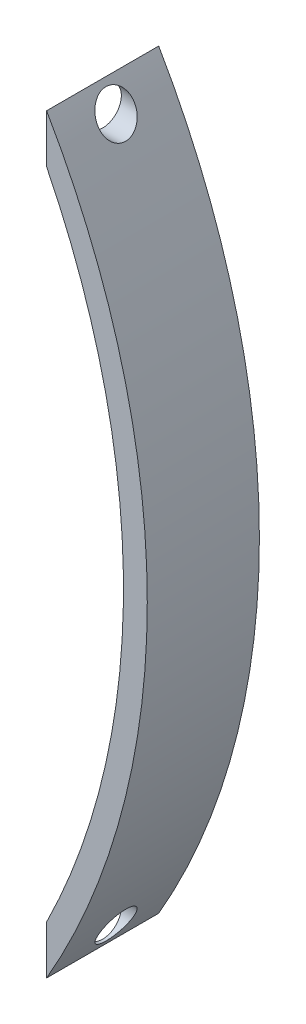
ISO-10303-21;
HEADER;
FILE_DESCRIPTION(('STEP AP214'),'2;1');
FILE_NAME('part.step','',(''),(''),'','','');
FILE_SCHEMA(('AUTOMOTIVE_DESIGN { 1 0 10303 214 1 1 1 1 }'));
ENDSEC;
DATA;
#1=APPLICATION_CONTEXT('core data for automotive mechanical design processes');
#2=APPLICATION_PROTOCOL_DEFINITION('international standard','automotive_design',2000,#1);
#3=PRODUCT_CONTEXT('',#1,'mechanical');
#4=PRODUCT('Part','Part','',(#3));
#5=PRODUCT_RELATED_PRODUCT_CATEGORY('part','',(#4));
#6=PRODUCT_DEFINITION_FORMATION('','',#4);
#7=PRODUCT_DEFINITION_CONTEXT('part definition',#1,'design');
#8=PRODUCT_DEFINITION('design','',#6,#7);
#9=PRODUCT_DEFINITION_SHAPE('','',#8);
#10=(LENGTH_UNIT() NAMED_UNIT(*) SI_UNIT(.MILLI.,.METRE.));
#11=(NAMED_UNIT(*) PLANE_ANGLE_UNIT() SI_UNIT($,.RADIAN.));
#12=(NAMED_UNIT(*) SI_UNIT($,.STERADIAN.) SOLID_ANGLE_UNIT());
#13=UNCERTAINTY_MEASURE_WITH_UNIT(LENGTH_MEASURE(1.E-05),#10,'distance_accuracy_value','');
#14=(GEOMETRIC_REPRESENTATION_CONTEXT(3) GLOBAL_UNCERTAINTY_ASSIGNED_CONTEXT((#13)) GLOBAL_UNIT_ASSIGNED_CONTEXT((#10,
#11,#12)) REPRESENTATION_CONTEXT('',''));
#15=CARTESIAN_POINT('',(0.,0.,0.));
#16=DIRECTION('',(0.,0.,1.));
#17=DIRECTION('',(1.,0.,0.));
#18=AXIS2_PLACEMENT_3D('',#15,#16,#17);
#19=CARTESIAN_POINT('',(-86.9980738008034,50.25,15.));
#20=DIRECTION('',(0.,0.,-1.));
#21=DIRECTION('',(-1.,0.,0.));
#22=AXIS2_PLACEMENT_3D('',#19,#20,#21);
#23=CYLINDRICAL_SURFACE('',#22,100.467543739508);
#24=CARTESIAN_POINT('',(1.79791341173922,97.25,10.));
#25=CARTESIAN_POINT('',(1.87936773438583,97.0961088742316,9.99999567792544));
#26=CARTESIAN_POINT('',(1.96048666533414,96.9418767486017,9.9857715873209));
#27=CARTESIAN_POINT('',(2.11983634541733,96.6370144924125,9.92865195474345));
#28=CARTESIAN_POINT('',(2.19806275878423,96.4863898796602,9.88571507671167));
#29=CARTESIAN_POINT('',(2.34949925571092,96.1930716985299,9.77106921956604));
#30=CARTESIAN_POINT('',(2.42269401278266,96.0504025921076,9.69927653044506));
#31=CARTESIAN_POINT('',(2.56129070116935,95.7787910783674,9.52763647986744));
#32=CARTESIAN_POINT('',(2.62669791029108,95.6498393808228,9.42780827463924));
#33=CARTESIAN_POINT('',(2.74243620610943,95.4206038733157,9.21063913757986));
#34=CARTESIAN_POINT('',(2.79354068787223,95.3188766044154,9.09524075809203));
#35=CARTESIAN_POINT('',(2.8846735757628,95.1368517765714,8.84480467929541));
#36=CARTESIAN_POINT('',(2.92471163604546,95.056535541198,8.7097842558416));
#37=CARTESIAN_POINT('',(2.98781358214578,94.929658324639,8.44100243930656));
#38=CARTESIAN_POINT('',(3.01230809705417,94.880261727455,8.30891330904623));
#39=CARTESIAN_POINT('',(3.04996257298751,94.8042402323533,8.03681276923824));
#40=CARTESIAN_POINT('',(3.06313013534126,94.7776000630604,7.89680673993662));
#41=CARTESIAN_POINT('',(3.07685395984365,94.7498307776483,7.62636866967205));
#42=CARTESIAN_POINT('',(3.0784297824518,94.7466392513902,7.49619570954678));
#43=CARTESIAN_POINT('',(3.07159480892241,94.7604729616393,7.23721180781717));
#44=CARTESIAN_POINT('',(3.06318617957645,94.7774938117259,7.10840057681465));
#45=CARTESIAN_POINT('',(3.03708397720449,94.8302482337899,6.85921252314496));
#46=CARTESIAN_POINT('',(3.01963678347235,94.8654852071127,6.73870361037012));
#47=CARTESIAN_POINT('',(2.97626579672946,94.952884972696,6.50563633478395));
#48=CARTESIAN_POINT('',(2.95034105665887,95.0050496560122,6.3930788619682));
#49=CARTESIAN_POINT('',(2.88972565738102,95.1266713255975,6.17419390976188));
#50=CARTESIAN_POINT('',(2.85473078683838,95.1967268437425,6.06828455574596));
#51=CARTESIAN_POINT('',(2.77766222382068,95.3504651042075,5.86980288615052));
#52=CARTESIAN_POINT('',(2.73558631408516,95.4341521146433,5.77723476496997));
#53=CARTESIAN_POINT('',(2.64161388643502,95.6203151894992,5.59944936718113));
#54=CARTESIAN_POINT('',(2.58918239922431,95.7237908642191,5.51556340588586));
#55=CARTESIAN_POINT('',(2.47879320436929,95.9406164500668,5.36625566831722));
#56=CARTESIAN_POINT('',(2.42083318895307,96.0539704829943,5.30084164830352));
#57=CARTESIAN_POINT('',(2.29432734861406,96.3001416329769,5.18303660429051));
#58=CARTESIAN_POINT('',(2.22531243152958,96.4337434958911,5.1327880438583));
#59=CARTESIAN_POINT('',(2.08393236593123,96.7058615423738,5.05583735352777));
#60=CARTESIAN_POINT('',(2.01156574414011,96.8443798806586,5.0291456837019));
#61=CARTESIAN_POINT('',(1.85831520713259,97.1360216630261,4.99790896646522));
#62=CARTESIAN_POINT('',(1.77726478415106,97.289306010586,4.99565277321066));
#63=CARTESIAN_POINT('',(1.61524226247395,97.5938205657025,5.01904743262772));
#64=CARTESIAN_POINT('',(1.53427020427005,97.7450499857346,5.04470869499304));
#65=CARTESIAN_POINT('',(1.3714671515547,98.0473029116082,5.12519193369665));
#66=CARTESIAN_POINT('',(1.28972790056361,98.1980837882153,5.18112245514838));
#67=CARTESIAN_POINT('',(1.13146046889652,98.4883650966071,5.32227424075968));
#68=CARTESIAN_POINT('',(1.05493229329657,98.6278655174036,5.40749553345051));
#69=CARTESIAN_POINT('',(0.913511603222554,98.8843603164312,5.60169614716234));
#70=CARTESIAN_POINT('',(0.848250655570447,99.002084554881,5.70943511987611));
#71=CARTESIAN_POINT('',(0.728588615258266,99.2170827607754,5.94873984702288));
#72=CARTESIAN_POINT('',(0.674176915492529,99.314376707527,6.08028208698109));
#73=CARTESIAN_POINT('',(0.585338774966522,99.4727637637595,6.34661905955603));
#74=CARTESIAN_POINT('',(0.549289841537918,99.5368143980918,6.47908959869441));
#75=CARTESIAN_POINT('',(0.505170800471924,99.6150728258223,6.68642048716182));
#76=CARTESIAN_POINT('',(0.492122859126431,99.6381905327962,6.75697436618099));
#77=CARTESIAN_POINT('',(0.469544701908746,99.6781658750274,6.90037491493815));
#78=CARTESIAN_POINT('',(0.460014007095623,99.6950243626001,6.97322127104399));
#79=CARTESIAN_POINT('',(0.43900939385421,99.7321646078865,7.17483260021682));
#80=CARTESIAN_POINT('',(0.431267660978843,99.7458343209368,7.30529454387335));
#81=CARTESIAN_POINT('',(0.427476755917282,99.7525298957229,7.56681821665048));
#82=CARTESIAN_POINT('',(0.431422804434216,99.7455641955668,7.6978796787357));
#83=CARTESIAN_POINT('',(0.450142425330082,99.7124821636472,7.94852508579311));
#84=CARTESIAN_POINT('',(0.464238645773589,99.6875638124379,8.06832060110659));
#85=CARTESIAN_POINT('',(0.501775493756182,99.6210964309896,8.30163803500632));
#86=CARTESIAN_POINT('',(0.525216839029751,99.579546123364,8.41515947096119));
#87=CARTESIAN_POINT('',(0.581300946626077,99.4799077954976,8.63700915922312));
#88=CARTESIAN_POINT('',(0.614224370405449,99.421314696904,8.74503818134841));
#89=CARTESIAN_POINT('',(0.687549647431888,99.2904364131782,8.94961441148921));
#90=CARTESIAN_POINT('',(0.727953724316032,99.21814715669,9.04615819144398));
#91=CARTESIAN_POINT('',(0.819253099817941,99.0542424738919,9.23549094835539));
#92=CARTESIAN_POINT('',(0.870796092987442,98.9614120340037,9.32691341430057));
#93=CARTESIAN_POINT('',(0.979543132201639,98.7647287455619,9.4930362844153));
#94=CARTESIAN_POINT('',(1.03675135760948,98.6608677553797,9.56772420862691));
#95=CARTESIAN_POINT('',(1.16273257014716,98.431104198751,9.70801393724732));
#96=CARTESIAN_POINT('',(1.23205359310011,98.3040745768948,9.77127651718508));
#97=CARTESIAN_POINT('',(1.37382493495465,98.0428541539767,9.87510425457173));
#98=CARTESIAN_POINT('',(1.44627291804724,97.9086686812029,9.91568604875003));
#99=CARTESIAN_POINT('',(1.56553084690691,97.6865348391872,9.96316225845433));
#100=CARTESIAN_POINT('',(1.61194226032337,97.5997851422026,9.97696090184725));
#101=CARTESIAN_POINT('',(1.70490993192866,97.4253939600051,9.99538129383362));
#102=CARTESIAN_POINT('',(1.75146619905362,97.3377524189846,10.0000024645508));
#103=CARTESIAN_POINT('',(1.79791341173922,97.25,10.));
#104=B_SPLINE_CURVE_WITH_KNOTS('',3,(#24,#25,#26,#27,#28,#29,#30,#31,#32,#33,#34,#35,#36,#37,
#38,#39,#40,#41,#42,#43,#44,#45,#46,#47,#48,#49,#50,#51,#52,#53,#54,#55,#56,#57,#58,#59,#60,#61,
#62,#63,#64,#65,#66,#67,#68,#69,#70,#71,#72,#73,#74,#75,#76,#77,#78,#79,#80,#81,#82,#83,#84,#85,
#86,#87,#88,#89,#90,#91,#92,#93,#94,#95,#96,#97,#98,#99,#100,#101,#102,#103),.UNSPECIFIED.,.T.,
.F.,(4,2,2,2,2,2,2,2,2,2,2,2,2,2,2,2,2,2,2,2,2,2,2,2,2,2,2,2,2,2,2,2,2,2,2,2,2,2,2,4),(0.,
0.522010079809496,1.04477328838955,1.56906409402967,2.09299752796377,2.57655318877689,
3.05968566287875,3.48675106465453,3.91352964588351,4.30226444364088,4.69091489491925,
5.06948895787462,5.44810532727443,5.84158732217042,6.23519275670479,6.66289303927082,
7.09077264453548,7.56443660073855,8.03831077442074,8.55622661451554,9.07433563817732,
9.61284762877023,10.151360143913,10.6656624921102,11.1794595241159,11.6310178556015,
11.8568336383025,12.0826186604749,12.4745750860867,12.8663712573782,13.2341920044451,
13.6020410067268,13.9821513291225,14.3623748219024,14.7810406442563,15.2000176594005,
15.6719152026247,16.1434661454094,16.4411100993415,16.7387727943728),.UNSPECIFIED.);
#105=CARTESIAN_POINT('',(1.79791341173922,97.25,10.));
#106=VERTEX_POINT('',#105);
#107=EDGE_CURVE('E111',#106,#106,#104,.T.);
#108=ORIENTED_EDGE('',*,*,#107,.F.);
#109=EDGE_LOOP('',(#108));
#110=FACE_BOUND('',#109,.T.);
#111=CARTESIAN_POINT('',(1.79791341173924,3.25,10.));
#112=CARTESIAN_POINT('',(1.71498155689866,3.09332031531617,9.99999565535621));
#113=CARTESIAN_POINT('',(1.63155563101205,2.93671777671489,9.98524978275449));
#114=CARTESIAN_POINT('',(1.46608880594037,2.62805060753801,9.92650570714993));
#115=CARTESIAN_POINT('',(1.38405060036684,2.47599444132791,9.88245610844017));
#116=CARTESIAN_POINT('',(1.22381976541395,2.18074696421687,9.76538186243275));
#117=CARTESIAN_POINT('',(1.14563520403863,2.03757410177792,9.692299105296));
#118=CARTESIAN_POINT('',(0.99622756838789,1.76542138574464,9.51794633805366));
#119=CARTESIAN_POINT('',(0.925000432062257,1.63643324488455,9.41669290973704));
#120=CARTESIAN_POINT('',(0.797217653488029,1.40606106467847,9.19520048935927));
#121=CARTESIAN_POINT('',(0.740002486575178,1.30341407216244,9.07666468046439));
#122=CARTESIAN_POINT('',(0.637643029839892,1.12038051804288,8.81894399911094));
#123=CARTESIAN_POINT('',(0.592485232282955,1.03996904260952,8.67978250759011));
#124=CARTESIAN_POINT('',(0.522299369520701,0.915265007928446,8.40481759384518));
#125=CARTESIAN_POINT('',(0.495393394558577,0.867592026404179,8.27102690381544));
#126=CARTESIAN_POINT('',(0.454644614407163,0.795463865020279,7.99545317765124));
#127=CARTESIAN_POINT('',(0.440789343510864,0.770986529122783,7.85367790568467));
#128=CARTESIAN_POINT('',(0.427886311169657,0.748192218076026,7.58414967611788));
#129=CARTESIAN_POINT('',(0.427298451231524,0.747154348134016,7.45669238176067));
#130=CARTESIAN_POINT('',(0.437063136747791,0.764403365556297,7.20353775112893));
#131=CARTESIAN_POINT('',(0.447413157233848,0.782685792902975,7.07784001545269));
#132=CARTESIAN_POINT('',(0.477967232873414,0.836737611907303,6.83588762433802));
#133=CARTESIAN_POINT('',(0.497842388068148,0.871923426170324,6.71945911970021));
#134=CARTESIAN_POINT('',(0.546335779443629,0.957950725829988,6.49450488773545));
#135=CARTESIAN_POINT('',(0.574955496540953,1.00879486302,6.38598050285189));
#136=CARTESIAN_POINT('',(0.641622279187611,1.1275418335191,6.17301775220625));
#137=CARTESIAN_POINT('',(0.680118023311454,1.19625968585542,6.06917646949187));
#138=CARTESIAN_POINT('',(0.764065350863884,1.34660863243011,5.8745007615942));
#139=CARTESIAN_POINT('',(0.809519725095787,1.42824490812931,5.78367158341756));
#140=CARTESIAN_POINT('',(0.911414132637555,1.61193370626247,5.60664387894264));
#141=CARTESIAN_POINT('',(0.968515477102709,1.71525179533294,5.52214076870061));
#142=CARTESIAN_POINT('',(1.08772142235707,1.93193569151474,5.37158832140253));
#143=CARTESIAN_POINT('',(1.14982846807217,2.04530641135571,5.30554807336387));
#144=CARTESIAN_POINT('',(1.28532914867332,2.2938690274037,5.1854505357883));
#145=CARTESIAN_POINT('',(1.35916849927527,2.4300252981333,5.13388670845079));
#146=CARTESIAN_POINT('',(1.5090791966519,2.70805852842186,5.05516906463206));
#147=CARTESIAN_POINT('',(1.58515156627936,2.84993812109272,5.02802662058835));
#148=CARTESIAN_POINT('',(1.74420345844063,3.14833870700525,4.99719465760791));
#149=CARTESIAN_POINT('',(1.82721723418536,3.3050740488243,4.99570970389582));
#150=CARTESIAN_POINT('',(1.99141621406579,3.61708124207521,5.02214367909663));
#151=CARTESIAN_POINT('',(2.07260095521936,3.77235271730187,5.05006996930693));
#152=CARTESIAN_POINT('',(2.23164698769991,4.07842531232675,5.13584640040499));
#153=CARTESIAN_POINT('',(2.30946576503619,4.22916442181204,5.19399985089274));
#154=CARTESIAN_POINT('',(2.45834221119554,4.51922760116459,5.34004747022992));
#155=CARTESIAN_POINT('',(2.52940206028464,4.65855535003114,5.4279320065846));
#156=CARTESIAN_POINT('',(2.65736629744787,4.91074518128276,5.62497685525234));
#157=CARTESIAN_POINT('',(2.71491379387052,5.02477784784645,5.73221387546571));
#158=CARTESIAN_POINT('',(2.8194237968599,5.23269189724999,5.96908619550574));
#159=CARTESIAN_POINT('',(2.86639576457271,5.32659128823316,6.09870129039096));
#160=CARTESIAN_POINT('',(2.94281497741734,5.4798047717831,6.36057300152511));
#161=CARTESIAN_POINT('',(2.97365313358633,5.54184811591464,6.49082718681632));
#162=CARTESIAN_POINT('',(3.0238289536657,5.64296475597457,6.76202415661438));
#163=CARTESIAN_POINT('',(3.04317552976781,5.68205585204128,6.9029585622655));
#164=CARTESIAN_POINT('',(3.06808521607726,5.73241867537547,7.17609026330423));
#165=CARTESIAN_POINT('',(3.07483887123932,5.7460928555461,7.30774075514967));
#166=CARTESIAN_POINT('',(3.07798086288084,5.75245239133028,7.57165482489517));
#167=CARTESIAN_POINT('',(3.07437248590194,5.74514440189091,7.70391819512244));
#168=CARTESIAN_POINT('',(3.05733034036883,5.71067059473127,7.95935264852227));
#169=CARTESIAN_POINT('',(3.04432344028371,5.68436753692224,8.08267065517149));
#170=CARTESIAN_POINT('',(3.00947671571719,5.61403106086459,8.32280823016777));
#171=CARTESIAN_POINT('',(2.98763644624458,5.56999674938404,8.43962747079468));
#172=CARTESIAN_POINT('',(2.93527085991517,5.46468559966426,8.66671184454073));
#173=CARTESIAN_POINT('',(2.90454612454497,5.40301325730491,8.77674669311623));
#174=CARTESIAN_POINT('',(2.83567636909445,5.26521816833797,8.98474688614781));
#175=CARTESIAN_POINT('',(2.79752970415139,5.18909221858375,9.08270954726647));
#176=CARTESIAN_POINT('',(2.71173312461115,5.01851024380463,9.27195482179707));
#177=CARTESIAN_POINT('',(2.66357727302232,4.92309350136968,9.36214009821695));
#178=CARTESIAN_POINT('',(2.56130753721788,4.7213567427837,9.52533114767727));
#179=CARTESIAN_POINT('',(2.50718965387701,4.61502941150467,9.59832528524066));
#180=CARTESIAN_POINT('',(2.3883798100504,4.38271317576794,9.73312515223343));
#181=CARTESIAN_POINT('',(2.32317458187229,4.25583326689086,9.79293958166985));
#182=CARTESIAN_POINT('',(2.18884197838382,3.99588920007349,9.89016498834813));
#183=CARTESIAN_POINT('',(2.11971778586542,3.86283007603848,9.92759386859079));
#184=CARTESIAN_POINT('',(2.00813071455346,3.64923925604467,9.96923146775107));
#185=CARTESIAN_POINT('',(1.96642383196839,3.56966552000438,9.98077411576038));
#186=CARTESIAN_POINT('',(1.88249206333663,3.41005448693794,9.9961595501675));
#187=CARTESIAN_POINT('',(1.84026716937954,3.33001718284264,10.0000022188337));
#188=CARTESIAN_POINT('',(1.79791341173924,3.25,10.));
#189=B_SPLINE_CURVE_WITH_KNOTS('',3,(#111,#112,#113,#114,#115,#116,#117,#118,#119,#120,#121,
#122,#123,#124,#125,#126,#127,#128,#129,#130,#131,#132,#133,#134,#135,#136,#137,#138,#139,#140,
#141,#142,#143,#144,#145,#146,#147,#148,#149,#150,#151,#152,#153,#154,#155,#156,#157,#158,#159,
#160,#161,#162,#163,#164,#165,#166,#167,#168,#169,#170,#171,#172,#173,#174,#175,#176,#177,#178,
#179,#180,#181,#182,#183,#184,#185,#186,#187,#188),.UNSPECIFIED.,.T.,.F.,(4,2,2,2,2,2,2,2,2,2,2,
2,2,2,2,2,2,2,2,2,2,2,2,2,2,2,2,2,2,2,2,2,2,2,2,2,2,2,4),(0.,0.531500215067377,1.06393509297362,
1.59744105163135,2.13063364058452,2.62848606346382,3.12577838524491,3.55696440834917,
3.98773815441917,4.36821248046747,4.74859899463781,5.11670565552359,5.4848746909111,
5.87428731448777,6.26385652563166,6.69763802936501,7.1316327033437,7.61932236866847,
8.10723902171002,8.63688856188648,9.16667069878626,9.70187451354526,10.2369050948571,
10.7344301165897,11.2315082549215,11.6716603291733,12.1114706002267,12.5070482921753,
12.9025005319989,13.2810378838935,13.6595943074209,14.047412661656,14.4353170630672,
14.8531284503216,15.2712218173156,15.7334001298762,16.1952083160776,16.4666442697918,
16.7380843736941),.UNSPECIFIED.);
#190=CARTESIAN_POINT('',(1.79791341173924,3.25,10.));
#191=VERTEX_POINT('',#190);
#192=EDGE_CURVE('E128',#191,#191,#189,.T.);
#193=ORIENTED_EDGE('',*,*,#192,.F.);
#194=EDGE_LOOP('',(#193));
#195=FACE_BOUND('',#194,.T.);
#196=CARTESIAN_POINT('',(-86.9980738008034,50.25,0.));
#197=DIRECTION('',(0.,0.,1.));
#198=DIRECTION('',(-1.,0.,0.));
#199=AXIS2_PLACEMENT_3D('',#196,#197,#198);
#200=CIRCLE('',#199,100.467543739508);
#201=CARTESIAN_POINT('',(0.,0.,0.));
#202=VERTEX_POINT('',#201);
#203=CARTESIAN_POINT('',(0.,100.5,0.));
#204=VERTEX_POINT('',#203);
#205=EDGE_CURVE('E107',#202,#204,#200,.T.);
#206=ORIENTED_EDGE('',*,*,#205,.T.);
#207=DIRECTION('',(0.,0.,-1.));
#208=VECTOR('',#207,1.);
#209=CARTESIAN_POINT('',(0.,100.5,15.));
#210=LINE('',#209,#208);
#211=CARTESIAN_POINT('',(0.,100.5,15.));
#212=VERTEX_POINT('',#211);
#213=EDGE_CURVE('E11',#212,#204,#210,.T.);
#214=ORIENTED_EDGE('',*,*,#213,.F.);
#215=CARTESIAN_POINT('',(-86.9980738008034,50.25,15.));
#216=DIRECTION('',(0.,0.,1.));
#217=DIRECTION('',(-1.,0.,0.));
#218=AXIS2_PLACEMENT_3D('',#215,#216,#217);
#219=CIRCLE('',#218,100.467543739508);
#220=CARTESIAN_POINT('',(0.,0.,15.));
#221=VERTEX_POINT('',#220);
#222=EDGE_CURVE('E91',#221,#212,#219,.T.);
#223=ORIENTED_EDGE('',*,*,#222,.F.);
#224=DIRECTION('',(0.,0.,-1.));
#225=VECTOR('',#224,1.);
#226=CARTESIAN_POINT('',(0.,0.,15.));
#227=LINE('',#226,#225);
#228=EDGE_CURVE('E103',#221,#202,#227,.T.);
#229=ORIENTED_EDGE('',*,*,#228,.T.);
#230=EDGE_LOOP('',(#206,#214,#223,#229));
#231=FACE_BOUND('',#230,.T.);
#232=ADVANCED_FACE('F39',(#110,#195,#231),#23,.T.);
#233=CARTESIAN_POINT('',(0.,94.,15.));
#234=DIRECTION('',(1.,0.,0.));
#235=DIRECTION('',(0.,0.,-1.));
#236=AXIS2_PLACEMENT_3D('',#233,#234,#235);
#237=PLANE('',#236);
#238=CARTESIAN_POINT('',(0.,97.25,7.5));
#239=DIRECTION('',(-1.,0.,0.));
#240=DIRECTION('',(0.,0.,1.));
#241=AXIS2_PLACEMENT_3D('',#238,#239,#240);
#242=CIRCLE('',#241,2.5);
#243=CARTESIAN_POINT('',(0.,97.25,10.));
#244=VERTEX_POINT('',#243);
#245=EDGE_CURVE('E137',#244,#244,#242,.T.);
#246=ORIENTED_EDGE('',*,*,#245,.F.);
#247=EDGE_LOOP('',(#246));
#248=FACE_BOUND('',#247,.T.);
#249=DIRECTION('',(0.,-1.,0.));
#250=VECTOR('',#249,1.);
#251=CARTESIAN_POINT('',(0.,94.,0.));
#252=LINE('',#251,#250);
#253=CARTESIAN_POINT('',(0.,94.,0.));
#254=VERTEX_POINT('',#253);
#255=EDGE_CURVE('E96',#204,#254,#252,.T.);
#256=ORIENTED_EDGE('',*,*,#255,.T.);
#257=DIRECTION('',(0.,0.,-1.));
#258=VECTOR('',#257,1.);
#259=CARTESIAN_POINT('',(0.,94.,15.));
#260=LINE('',#259,#258);
#261=CARTESIAN_POINT('',(0.,94.,15.));
#262=VERTEX_POINT('',#261);
#263=EDGE_CURVE('E48',#262,#254,#260,.T.);
#264=ORIENTED_EDGE('',*,*,#263,.F.);
#265=DIRECTION('',(0.,-1.,0.));
#266=VECTOR('',#265,1.);
#267=CARTESIAN_POINT('',(0.,94.,15.));
#268=LINE('',#267,#266);
#269=EDGE_CURVE('E86',#212,#262,#268,.T.);
#270=ORIENTED_EDGE('',*,*,#269,.F.);
#271=ORIENTED_EDGE('',*,*,#213,.T.);
#272=EDGE_LOOP('',(#256,#264,#270,#271));
#273=FACE_BOUND('',#272,.T.);
#274=ADVANCED_FACE('F95',(#248,#273),#237,.F.);
#275=CARTESIAN_POINT('',(-87.9132973409999,50.25,15.));
#276=DIRECTION('',(0.,0.,-1.));
#277=DIRECTION('',(-1.,0.,0.));
#278=AXIS2_PLACEMENT_3D('',#275,#276,#277);
#279=CYLINDRICAL_SURFACE('',#278,98.1978123451183);
#280=CARTESIAN_POINT('',(-87.9132973409999,50.25,0.));
#281=DIRECTION('',(0.,0.,-1.));
#282=DIRECTION('',(1.,0.,0.));
#283=AXIS2_PLACEMENT_3D('',#280,#281,#282);
#284=CIRCLE('',#283,98.1978123451183);
#285=CARTESIAN_POINT('',(0.,6.5,0.));
#286=VERTEX_POINT('',#285);
#287=EDGE_CURVE('E73',#254,#286,#284,.T.);
#288=ORIENTED_EDGE('',*,*,#287,.T.);
#289=DIRECTION('',(0.,0.,-1.));
#290=VECTOR('',#289,1.);
#291=CARTESIAN_POINT('',(0.,6.5,15.));
#292=LINE('',#291,#290);
#293=CARTESIAN_POINT('',(0.,6.5,15.));
#294=VERTEX_POINT('',#293);
#295=EDGE_CURVE('E98',#294,#286,#292,.T.);
#296=ORIENTED_EDGE('',*,*,#295,.F.);
#297=CARTESIAN_POINT('',(-87.9132973409999,50.25,15.));
#298=DIRECTION('',(0.,0.,-1.));
#299=DIRECTION('',(1.,0.,0.));
#300=AXIS2_PLACEMENT_3D('',#297,#298,#299);
#301=CIRCLE('',#300,98.1978123451183);
#302=EDGE_CURVE('E89',#262,#294,#301,.T.);
#303=ORIENTED_EDGE('',*,*,#302,.F.);
#304=ORIENTED_EDGE('',*,*,#263,.T.);
#305=EDGE_LOOP('',(#288,#296,#303,#304));
#306=FACE_BOUND('',#305,.T.);
#307=ADVANCED_FACE('F99',(#306),#279,.F.);
#308=CARTESIAN_POINT('',(0.,0.,15.));
#309=DIRECTION('',(1.,0.,0.));
#310=DIRECTION('',(0.,0.,-1.));
#311=AXIS2_PLACEMENT_3D('',#308,#309,#310);
#312=PLANE('',#311);
#313=CARTESIAN_POINT('',(0.,3.25,7.5));
#314=DIRECTION('',(-1.,0.,0.));
#315=DIRECTION('',(0.,0.,1.));
#316=AXIS2_PLACEMENT_3D('',#313,#314,#315);
#317=CIRCLE('',#316,2.5);
#318=CARTESIAN_POINT('',(0.,3.25,10.));
#319=VERTEX_POINT('',#318);
#320=EDGE_CURVE('E138',#319,#319,#317,.T.);
#321=ORIENTED_EDGE('',*,*,#320,.F.);
#322=EDGE_LOOP('',(#321));
#323=FACE_BOUND('',#322,.T.);
#324=DIRECTION('',(0.,-1.,0.));
#325=VECTOR('',#324,1.);
#326=CARTESIAN_POINT('',(0.,0.,0.));
#327=LINE('',#326,#325);
#328=EDGE_CURVE('E79',#286,#202,#327,.T.);
#329=ORIENTED_EDGE('',*,*,#328,.T.);
#330=ORIENTED_EDGE('',*,*,#228,.F.);
#331=DIRECTION('',(0.,-1.,0.));
#332=VECTOR('',#331,1.);
#333=CARTESIAN_POINT('',(0.,0.,15.));
#334=LINE('',#333,#332);
#335=EDGE_CURVE('E56',#294,#221,#334,.T.);
#336=ORIENTED_EDGE('',*,*,#335,.F.);
#337=ORIENTED_EDGE('',*,*,#295,.T.);
#338=EDGE_LOOP('',(#329,#330,#336,#337));
#339=FACE_BOUND('',#338,.T.);
#340=ADVANCED_FACE('F121',(#323,#339),#312,.F.);
#341=CARTESIAN_POINT('',(-86.9980738008034,50.25,15.));
#342=DIRECTION('',(0.,0.,-1.));
#343=DIRECTION('',(-1.,0.,0.));
#344=AXIS2_PLACEMENT_3D('',#341,#342,#343);
#345=PLANE('',#344);
#346=ORIENTED_EDGE('',*,*,#222,.T.);
#347=ORIENTED_EDGE('',*,*,#269,.T.);
#348=ORIENTED_EDGE('',*,*,#302,.T.);
#349=ORIENTED_EDGE('',*,*,#335,.T.);
#350=EDGE_LOOP('',(#346,#347,#348,#349));
#351=FACE_BOUND('',#350,.T.);
#352=ADVANCED_FACE('F87',(#351),#345,.F.);
#353=CARTESIAN_POINT('',(-86.9980738008034,50.25,0.));
#354=DIRECTION('',(0.,0.,-1.));
#355=DIRECTION('',(-1.,0.,0.));
#356=AXIS2_PLACEMENT_3D('',#353,#354,#355);
#357=PLANE('',#356);
#358=ORIENTED_EDGE('',*,*,#205,.F.);
#359=ORIENTED_EDGE('',*,*,#328,.F.);
#360=ORIENTED_EDGE('',*,*,#287,.F.);
#361=ORIENTED_EDGE('',*,*,#255,.F.);
#362=EDGE_LOOP('',(#358,#359,#360,#361));
#363=FACE_BOUND('',#362,.T.);
#364=ADVANCED_FACE('F124',(#363),#357,.T.);
#365=CARTESIAN_POINT('',(13.470469938705,3.25,7.5));
#366=DIRECTION('',(-1.,0.,0.));
#367=DIRECTION('',(0.,0.,1.));
#368=AXIS2_PLACEMENT_3D('',#365,#366,#367);
#369=CYLINDRICAL_SURFACE('',#368,2.5);
#370=ORIENTED_EDGE('',*,*,#320,.T.);
#371=EDGE_LOOP('',(#370));
#372=FACE_BOUND('',#371,.T.);
#373=ORIENTED_EDGE('',*,*,#192,.T.);
#374=EDGE_LOOP('',(#373));
#375=FACE_BOUND('',#374,.T.);
#376=ADVANCED_FACE('F140',(#372,#375),#369,.F.);
#377=CARTESIAN_POINT('',(13.470469938705,97.25,7.5));
#378=DIRECTION('',(-1.,0.,0.));
#379=DIRECTION('',(0.,0.,1.));
#380=AXIS2_PLACEMENT_3D('',#377,#378,#379);
#381=CYLINDRICAL_SURFACE('',#380,2.5);
#382=ORIENTED_EDGE('',*,*,#245,.T.);
#383=EDGE_LOOP('',(#382));
#384=FACE_BOUND('',#383,.T.);
#385=ORIENTED_EDGE('',*,*,#107,.T.);
#386=EDGE_LOOP('',(#385));
#387=FACE_BOUND('',#386,.T.);
#388=ADVANCED_FACE('F145',(#384,#387),#381,.F.);
#389=CLOSED_SHELL('',(#232,#274,#307,#340,#352,#364,#376,#388));
#390=MANIFOLD_SOLID_BREP('B2',#389);
#391=ADVANCED_BREP_SHAPE_REPRESENTATION('',(#18,#390),#14);
#392=SHAPE_DEFINITION_REPRESENTATION(#9,#391);
ENDSEC;
END-ISO-10303-21;
